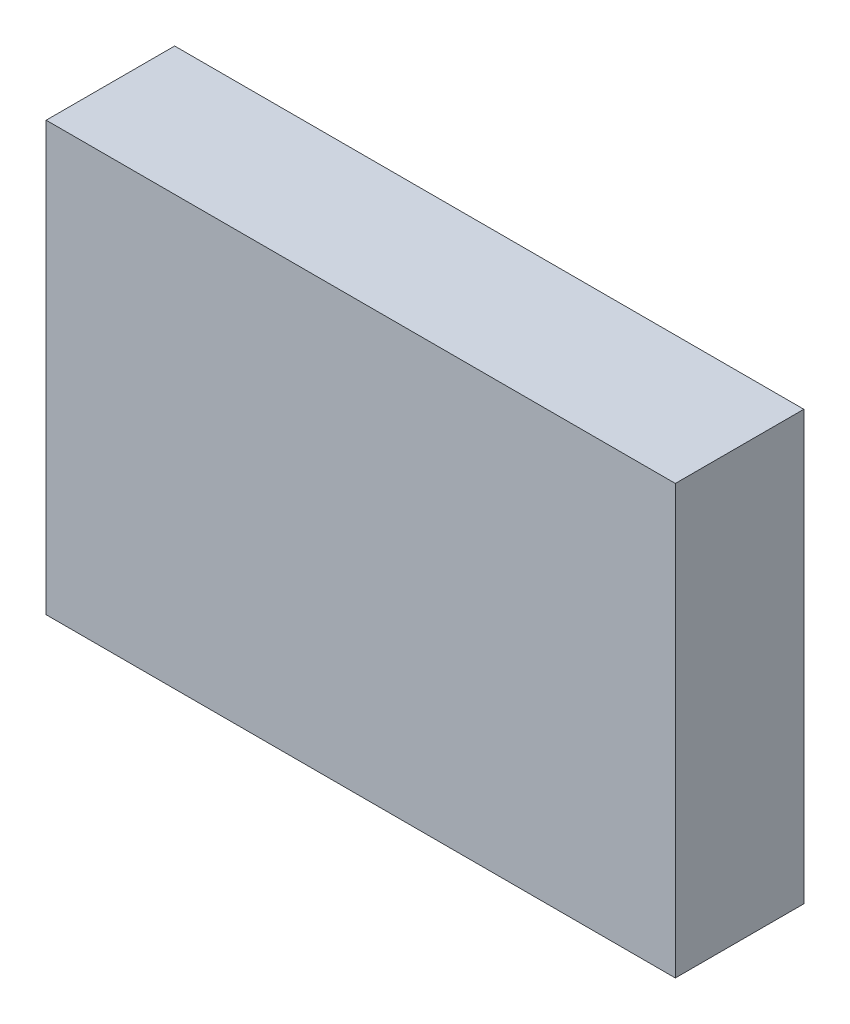
ISO-10303-21;
HEADER;
FILE_DESCRIPTION(('STEP AP214'),'2;1');
FILE_NAME('part.step','',(''),(''),'','','');
FILE_SCHEMA(('AUTOMOTIVE_DESIGN { 1 0 10303 214 1 1 1 1 }'));
ENDSEC;
DATA;
#1=APPLICATION_CONTEXT('core data for automotive mechanical design processes');
#2=APPLICATION_PROTOCOL_DEFINITION('international standard','automotive_design',2000,#1);
#3=PRODUCT_CONTEXT('',#1,'mechanical');
#4=PRODUCT('Part','Part','',(#3));
#5=PRODUCT_RELATED_PRODUCT_CATEGORY('part','',(#4));
#6=PRODUCT_DEFINITION_FORMATION('','',#4);
#7=PRODUCT_DEFINITION_CONTEXT('part definition',#1,'design');
#8=PRODUCT_DEFINITION('design','',#6,#7);
#9=PRODUCT_DEFINITION_SHAPE('','',#8);
#10=(LENGTH_UNIT() NAMED_UNIT(*) SI_UNIT(.MILLI.,.METRE.));
#11=(NAMED_UNIT(*) PLANE_ANGLE_UNIT() SI_UNIT($,.RADIAN.));
#12=(NAMED_UNIT(*) SI_UNIT($,.STERADIAN.) SOLID_ANGLE_UNIT());
#13=UNCERTAINTY_MEASURE_WITH_UNIT(LENGTH_MEASURE(1.E-05),#10,'distance_accuracy_value','');
#14=(GEOMETRIC_REPRESENTATION_CONTEXT(3) GLOBAL_UNCERTAINTY_ASSIGNED_CONTEXT((#13)) GLOBAL_UNIT_ASSIGNED_CONTEXT((#10,
#11,#12)) REPRESENTATION_CONTEXT('',''));
#15=CARTESIAN_POINT('',(0.,0.,0.));
#16=DIRECTION('',(0.,0.,1.));
#17=DIRECTION('',(1.,0.,0.));
#18=AXIS2_PLACEMENT_3D('',#15,#16,#17);
#19=CARTESIAN_POINT('',(-42.0873897006499,23.8366751269036,3.));
#20=DIRECTION('',(1.,0.,0.));
#21=DIRECTION('',(0.,1.,0.));
#22=AXIS2_PLACEMENT_3D('',#19,#20,#21);
#23=PLANE('',#22);
#24=DIRECTION('',(0.,-1.,0.));
#25=VECTOR('',#24,1.);
#26=CARTESIAN_POINT('',(-42.0873897006499,23.8366751269036,0.));
#27=LINE('',#26,#25);
#28=CARTESIAN_POINT('',(-42.0873897006499,23.8366751269036,0.));
#29=VERTEX_POINT('',#28);
#30=CARTESIAN_POINT('',(-42.0873897006499,13.8366751269036,0.));
#31=VERTEX_POINT('',#30);
#32=EDGE_CURVE('E96',#29,#31,#27,.T.);
#33=ORIENTED_EDGE('',*,*,#32,.T.);
#34=DIRECTION('',(0.,0.,-1.));
#35=VECTOR('',#34,1.);
#36=CARTESIAN_POINT('',(-42.0873897006499,13.8366751269036,3.));
#37=LINE('',#36,#35);
#38=CARTESIAN_POINT('',(-42.0873897006499,13.8366751269036,3.));
#39=VERTEX_POINT('',#38);
#40=EDGE_CURVE('E11',#39,#31,#37,.T.);
#41=ORIENTED_EDGE('',*,*,#40,.F.);
#42=DIRECTION('',(0.,-1.,0.));
#43=VECTOR('',#42,1.);
#44=CARTESIAN_POINT('',(-42.0873897006499,23.8366751269036,3.));
#45=LINE('',#44,#43);
#46=CARTESIAN_POINT('',(-42.0873897006499,23.8366751269036,3.));
#47=VERTEX_POINT('',#46);
#48=EDGE_CURVE('E84',#47,#39,#45,.T.);
#49=ORIENTED_EDGE('',*,*,#48,.F.);
#50=DIRECTION('',(0.,0.,-1.));
#51=VECTOR('',#50,1.);
#52=CARTESIAN_POINT('',(-42.0873897006499,23.8366751269036,3.));
#53=LINE('',#52,#51);
#54=EDGE_CURVE('E92',#47,#29,#53,.T.);
#55=ORIENTED_EDGE('',*,*,#54,.T.);
#56=EDGE_LOOP('',(#33,#41,#49,#55));
#57=FACE_BOUND('',#56,.T.);
#58=ADVANCED_FACE('F33',(#57),#23,.F.);
#59=CARTESIAN_POINT('',(-42.0873897006499,13.8366751269036,3.));
#60=DIRECTION('',(0.,1.,0.));
#61=DIRECTION('',(0.,0.,1.));
#62=AXIS2_PLACEMENT_3D('',#59,#60,#61);
#63=PLANE('',#62);
#64=DIRECTION('',(1.,0.,0.));
#65=VECTOR('',#64,1.);
#66=CARTESIAN_POINT('',(-42.0873897006499,13.8366751269036,0.));
#67=LINE('',#66,#65);
#68=CARTESIAN_POINT('',(-27.3973897006499,13.8366751269036,0.));
#69=VERTEX_POINT('',#68);
#70=EDGE_CURVE('E88',#31,#69,#67,.T.);
#71=ORIENTED_EDGE('',*,*,#70,.T.);
#72=DIRECTION('',(0.,0.,-1.));
#73=VECTOR('',#72,1.);
#74=CARTESIAN_POINT('',(-27.3973897006499,13.8366751269036,3.));
#75=LINE('',#74,#73);
#76=CARTESIAN_POINT('',(-27.3973897006499,13.8366751269036,3.));
#77=VERTEX_POINT('',#76);
#78=EDGE_CURVE('E41',#77,#69,#75,.T.);
#79=ORIENTED_EDGE('',*,*,#78,.F.);
#80=DIRECTION('',(1.,0.,0.));
#81=VECTOR('',#80,1.);
#82=CARTESIAN_POINT('',(-42.0873897006499,13.8366751269036,3.));
#83=LINE('',#82,#81);
#84=EDGE_CURVE('E79',#39,#77,#83,.T.);
#85=ORIENTED_EDGE('',*,*,#84,.F.);
#86=ORIENTED_EDGE('',*,*,#40,.T.);
#87=EDGE_LOOP('',(#71,#79,#85,#86));
#88=FACE_BOUND('',#87,.T.);
#89=ADVANCED_FACE('F87',(#88),#63,.F.);
#90=CARTESIAN_POINT('',(-27.3973897006499,23.8366751269036,3.));
#91=DIRECTION('',(-1.,0.,0.));
#92=DIRECTION('',(0.,-1.,0.));
#93=AXIS2_PLACEMENT_3D('',#90,#91,#92);
#94=PLANE('',#93);
#95=DIRECTION('',(0.,1.,0.));
#96=VECTOR('',#95,1.);
#97=CARTESIAN_POINT('',(-27.3973897006499,23.8366751269036,0.));
#98=LINE('',#97,#96);
#99=CARTESIAN_POINT('',(-27.3973897006499,23.8366751269036,0.));
#100=VERTEX_POINT('',#99);
#101=EDGE_CURVE('E66',#69,#100,#98,.T.);
#102=ORIENTED_EDGE('',*,*,#101,.T.);
#103=DIRECTION('',(0.,0.,-1.));
#104=VECTOR('',#103,1.);
#105=CARTESIAN_POINT('',(-27.3973897006499,23.8366751269036,3.));
#106=LINE('',#105,#104);
#107=CARTESIAN_POINT('',(-27.3973897006499,23.8366751269036,3.));
#108=VERTEX_POINT('',#107);
#109=EDGE_CURVE('E89',#108,#100,#106,.T.);
#110=ORIENTED_EDGE('',*,*,#109,.F.);
#111=DIRECTION('',(0.,1.,0.));
#112=VECTOR('',#111,1.);
#113=CARTESIAN_POINT('',(-27.3973897006499,23.8366751269036,3.));
#114=LINE('',#113,#112);
#115=EDGE_CURVE('E82',#77,#108,#114,.T.);
#116=ORIENTED_EDGE('',*,*,#115,.F.);
#117=ORIENTED_EDGE('',*,*,#78,.T.);
#118=EDGE_LOOP('',(#102,#110,#116,#117));
#119=FACE_BOUND('',#118,.T.);
#120=ADVANCED_FACE('F90',(#119),#94,.F.);
#121=CARTESIAN_POINT('',(-42.0873897006499,23.8366751269036,3.));
#122=DIRECTION('',(0.,-1.,0.));
#123=DIRECTION('',(0.,0.,-1.));
#124=AXIS2_PLACEMENT_3D('',#121,#122,#123);
#125=PLANE('',#124);
#126=DIRECTION('',(-1.,0.,0.));
#127=VECTOR('',#126,1.);
#128=CARTESIAN_POINT('',(-42.0873897006499,23.8366751269036,0.));
#129=LINE('',#128,#127);
#130=EDGE_CURVE('E72',#100,#29,#129,.T.);
#131=ORIENTED_EDGE('',*,*,#130,.T.);
#132=ORIENTED_EDGE('',*,*,#54,.F.);
#133=DIRECTION('',(-1.,0.,0.));
#134=VECTOR('',#133,1.);
#135=CARTESIAN_POINT('',(-42.0873897006499,23.8366751269036,3.));
#136=LINE('',#135,#134);
#137=EDGE_CURVE('E49',#108,#47,#136,.T.);
#138=ORIENTED_EDGE('',*,*,#137,.F.);
#139=ORIENTED_EDGE('',*,*,#109,.T.);
#140=EDGE_LOOP('',(#131,#132,#138,#139));
#141=FACE_BOUND('',#140,.T.);
#142=ADVANCED_FACE('F103',(#141),#125,.F.);
#143=CARTESIAN_POINT('',(0.,0.,3.));
#144=DIRECTION('',(0.,0.,1.));
#145=DIRECTION('',(1.,0.,0.));
#146=AXIS2_PLACEMENT_3D('',#143,#144,#145);
#147=PLANE('',#146);
#148=ORIENTED_EDGE('',*,*,#48,.T.);
#149=ORIENTED_EDGE('',*,*,#84,.T.);
#150=ORIENTED_EDGE('',*,*,#115,.T.);
#151=ORIENTED_EDGE('',*,*,#137,.T.);
#152=EDGE_LOOP('',(#148,#149,#150,#151));
#153=FACE_BOUND('',#152,.T.);
#154=ADVANCED_FACE('F80',(#153),#147,.T.);
#155=CARTESIAN_POINT('',(0.,0.,0.));
#156=DIRECTION('',(0.,0.,1.));
#157=DIRECTION('',(1.,0.,0.));
#158=AXIS2_PLACEMENT_3D('',#155,#156,#157);
#159=PLANE('',#158);
#160=ORIENTED_EDGE('',*,*,#32,.F.);
#161=ORIENTED_EDGE('',*,*,#130,.F.);
#162=ORIENTED_EDGE('',*,*,#101,.F.);
#163=ORIENTED_EDGE('',*,*,#70,.F.);
#164=EDGE_LOOP('',(#160,#161,#162,#163));
#165=FACE_BOUND('',#164,.T.);
#166=ADVANCED_FACE('F106',(#165),#159,.F.);
#167=CLOSED_SHELL('',(#58,#89,#120,#142,#154,#166));
#168=MANIFOLD_SOLID_BREP('B2',#167);
#169=ADVANCED_BREP_SHAPE_REPRESENTATION('',(#18,#168),#14);
#170=SHAPE_DEFINITION_REPRESENTATION(#9,#169);
ENDSEC;
END-ISO-10303-21;
